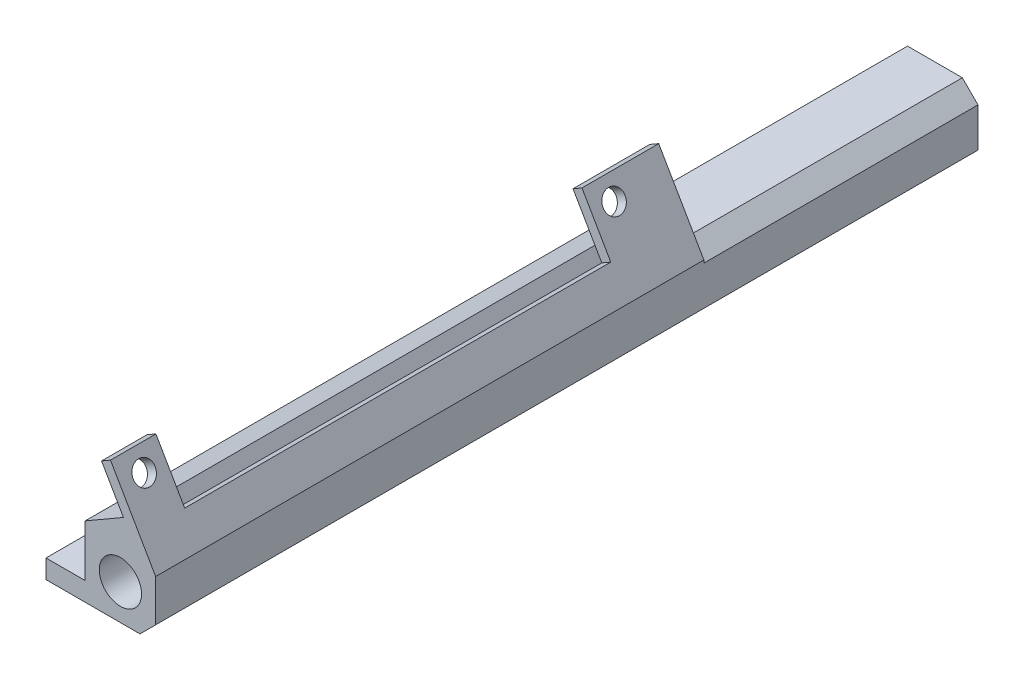
ISO-10303-21;
HEADER;
FILE_DESCRIPTION(('STEP AP214'),'2;1');
FILE_NAME('part.step','',(''),(''),'','','');
FILE_SCHEMA(('AUTOMOTIVE_DESIGN { 1 0 10303 214 1 1 1 1 }'));
ENDSEC;
DATA;
#1=APPLICATION_CONTEXT('core data for automotive mechanical design processes');
#2=APPLICATION_PROTOCOL_DEFINITION('international standard','automotive_design',2000,#1);
#3=PRODUCT_CONTEXT('',#1,'mechanical');
#4=PRODUCT('Part','Part','',(#3));
#5=PRODUCT_RELATED_PRODUCT_CATEGORY('part','',(#4));
#6=PRODUCT_DEFINITION_FORMATION('','',#4);
#7=PRODUCT_DEFINITION_CONTEXT('part definition',#1,'design');
#8=PRODUCT_DEFINITION('design','',#6,#7);
#9=PRODUCT_DEFINITION_SHAPE('','',#8);
#10=(LENGTH_UNIT() NAMED_UNIT(*) SI_UNIT(.MILLI.,.METRE.));
#11=(NAMED_UNIT(*) PLANE_ANGLE_UNIT() SI_UNIT($,.RADIAN.));
#12=(NAMED_UNIT(*) SI_UNIT($,.STERADIAN.) SOLID_ANGLE_UNIT());
#13=UNCERTAINTY_MEASURE_WITH_UNIT(LENGTH_MEASURE(1.E-05),#10,'distance_accuracy_value','');
#14=(GEOMETRIC_REPRESENTATION_CONTEXT(3) GLOBAL_UNCERTAINTY_ASSIGNED_CONTEXT((#13)) GLOBAL_UNIT_ASSIGNED_CONTEXT((#10,
#11,#12)) REPRESENTATION_CONTEXT('',''));
#15=CARTESIAN_POINT('',(0.,0.,0.));
#16=DIRECTION('',(0.,0.,1.));
#17=DIRECTION('',(1.,0.,0.));
#18=AXIS2_PLACEMENT_3D('',#15,#16,#17);
#19=CARTESIAN_POINT('',(69.3299914599108,20.0752380002228,-133.35));
#20=DIRECTION('',(0.866025403784438,0.500000000000001,0.));
#21=DIRECTION('',(-0.500000000000001,0.866025403784438,0.));
#22=AXIS2_PLACEMENT_3D('',#19,#20,#21);
#23=PLANE('',#22);
#24=CARTESIAN_POINT('',(70.3459914599109,18.3154743797327,-80.01));
#25=DIRECTION('',(0.866025403784438,0.500000000000001,0.));
#26=DIRECTION('',(-0.500000000000001,0.866025403784438,0.));
#27=AXIS2_PLACEMENT_3D('',#24,#25,#26);
#28=CIRCLE('',#27,1.77800000000001);
#29=CARTESIAN_POINT('',(69.4569914599109,19.8552675476615,-80.01));
#30=VERTEX_POINT('',#29);
#31=EDGE_CURVE('E331',#30,#30,#28,.F.);
#32=ORIENTED_EDGE('',*,*,#31,.F.);
#33=EDGE_LOOP('',(#32));
#34=FACE_BOUND('',#33,.T.);
#35=DIRECTION('',(0.,0.,1.));
#36=VECTOR('',#35,1.);
#37=CARTESIAN_POINT('',(72.2509914599109,15.015917591314,-133.35));
#38=LINE('',#37,#36);
#39=CARTESIAN_POINT('',(72.2509914599109,15.015917591314,-88.9));
#40=VERTEX_POINT('',#39);
#41=CARTESIAN_POINT('',(72.2509914599109,15.015917591314,-76.454));
#42=VERTEX_POINT('',#41);
#43=EDGE_CURVE('E321',#40,#42,#38,.T.);
#44=ORIENTED_EDGE('',*,*,#43,.T.);
#45=DIRECTION('',(0.500000000000001,-0.866025403784438,0.));
#46=VECTOR('',#45,1.);
#47=CARTESIAN_POINT('',(68.6949914599108,21.1750902630291,-76.454));
#48=LINE('',#47,#46);
#49=CARTESIAN_POINT('',(68.6949914599108,21.1750902630291,-76.454));
#50=VERTEX_POINT('',#49);
#51=EDGE_CURVE('E378',#50,#42,#48,.T.);
#52=ORIENTED_EDGE('',*,*,#51,.F.);
#53=DIRECTION('',(0.,0.,1.));
#54=VECTOR('',#53,1.);
#55=CARTESIAN_POINT('',(68.6949914599109,21.1750902630289,0.));
#56=LINE('',#55,#54);
#57=CARTESIAN_POINT('',(68.6949914599109,21.1750902630289,-88.9));
#58=VERTEX_POINT('',#57);
#59=EDGE_CURVE('E330',#58,#50,#56,.T.);
#60=ORIENTED_EDGE('',*,*,#59,.F.);
#61=DIRECTION('',(0.500000000000001,-0.866025403784438,0.));
#62=VECTOR('',#61,1.);
#63=CARTESIAN_POINT('',(60.6903266425389,35.0395764242762,-88.9));
#64=LINE('',#63,#62);
#65=EDGE_CURVE('E179',#58,#40,#64,.T.);
#66=ORIENTED_EDGE('',*,*,#65,.T.);
#67=EDGE_LOOP('',(#44,#52,#60,#66));
#68=FACE_BOUND('',#67,.T.);
#69=ADVANCED_FACE('F38',(#34,#68),#23,.F.);
#70=CARTESIAN_POINT('',(8.00466481737211,-13.8644861612474,0.));
#71=DIRECTION('',(-0.500000000000003,0.866025403784437,0.));
#72=DIRECTION('',(-0.866025403784437,-0.500000000000003,0.));
#73=AXIS2_PLACEMENT_3D('',#70,#71,#72);
#74=PLANE('',#73);
#75=DIRECTION('',(-0.866025403784438,-0.500000000000001,0.));
#76=VECTOR('',#75,1.);
#77=CARTESIAN_POINT('',(75.6404699470002,25.185064137201,-76.454));
#78=LINE('',#77,#76);
#79=CARTESIAN_POINT('',(70.1471477371937,22.0134930806238,-76.454));
#80=VERTEX_POINT('',#79);
#81=EDGE_CURVE('E364',#80,#50,#78,.T.);
#82=ORIENTED_EDGE('',*,*,#81,.F.);
#83=DIRECTION('',(0.,0.,-1.));
#84=VECTOR('',#83,1.);
#85=CARTESIAN_POINT('',(70.1471477371938,22.0134930806236,0.));
#86=LINE('',#85,#84);
#87=CARTESIAN_POINT('',(70.1471477371938,22.0134930806236,-88.9));
#88=VERTEX_POINT('',#87);
#89=EDGE_CURVE('E359',#80,#88,#86,.T.);
#90=ORIENTED_EDGE('',*,*,#89,.T.);
#91=DIRECTION('',(-0.866025403784437,-0.500000000000003,0.));
#92=VECTOR('',#91,1.);
#93=CARTESIAN_POINT('',(70.1471477371938,22.0134930806236,-88.9));
#94=LINE('',#93,#92);
#95=EDGE_CURVE('E175',#88,#58,#94,.T.);
#96=ORIENTED_EDGE('',*,*,#95,.T.);
#97=ORIENTED_EDGE('',*,*,#59,.T.);
#98=EDGE_LOOP('',(#82,#90,#96,#97));
#99=FACE_BOUND('',#98,.T.);
#100=ADVANCED_FACE('F411',(#99),#74,.T.);
#101=CARTESIAN_POINT('',(53.34,0.,-82.55));
#102=DIRECTION('',(0.,0.,1.));
#103=DIRECTION('',(1.,0.,0.));
#104=AXIS2_PLACEMENT_3D('',#101,#102,#103);
#105=PLANE('',#104);
#106=DIRECTION('',(-1.,0.,0.));
#107=VECTOR('',#106,1.);
#108=CARTESIAN_POINT('',(59.69,3.048,-82.55));
#109=LINE('',#108,#107);
#110=CARTESIAN_POINT('',(66.04,3.048,-82.55));
#111=VERTEX_POINT('',#110);
#112=CARTESIAN_POINT('',(59.69,3.048,-82.55));
#113=VERTEX_POINT('',#112);
#114=EDGE_CURVE('E344',#111,#113,#109,.T.);
#115=ORIENTED_EDGE('',*,*,#114,.F.);
#116=DIRECTION('',(0.,1.,0.));
#117=VECTOR('',#116,1.);
#118=CARTESIAN_POINT('',(66.04,0.,-82.55));
#119=LINE('',#118,#117);
#120=CARTESIAN_POINT('',(66.04,0.,-82.55));
#121=VERTEX_POINT('',#120);
#122=EDGE_CURVE('E211',#121,#111,#119,.T.);
#123=ORIENTED_EDGE('',*,*,#122,.F.);
#124=DIRECTION('',(1.,0.,0.));
#125=VECTOR('',#124,1.);
#126=CARTESIAN_POINT('',(53.34,0.,-82.55));
#127=LINE('',#126,#125);
#128=CARTESIAN_POINT('',(59.69,0.,-82.55));
#129=VERTEX_POINT('',#128);
#130=EDGE_CURVE('E219',#129,#121,#127,.T.);
#131=ORIENTED_EDGE('',*,*,#130,.F.);
#132=DIRECTION('',(0.,-1.,0.));
#133=VECTOR('',#132,1.);
#134=CARTESIAN_POINT('',(59.69,5.08,-82.55));
#135=LINE('',#134,#133);
#136=EDGE_CURVE('E266',#113,#129,#135,.T.);
#137=ORIENTED_EDGE('',*,*,#136,.F.);
#138=EDGE_LOOP('',(#115,#123,#131,#137));
#139=FACE_BOUND('',#138,.T.);
#140=ADVANCED_FACE('F408',(#139),#105,.F.);
#141=CARTESIAN_POINT('',(62.23,0.,-13.97));
#142=DIRECTION('',(0.,1.,0.));
#143=DIRECTION('',(0.,0.,1.));
#144=AXIS2_PLACEMENT_3D('',#141,#142,#143);
#145=CYLINDRICAL_SURFACE('',#144,1.778);
#146=CARTESIAN_POINT('',(62.23,0.,-13.97));
#147=DIRECTION('',(0.,1.,0.));
#148=DIRECTION('',(0.,0.,1.));
#149=AXIS2_PLACEMENT_3D('',#146,#147,#148);
#150=CIRCLE('',#149,1.778);
#151=CARTESIAN_POINT('',(62.23,0.,-12.192));
#152=VERTEX_POINT('',#151);
#153=EDGE_CURVE('E205',#152,#152,#150,.T.);
#154=ORIENTED_EDGE('',*,*,#153,.F.);
#155=EDGE_LOOP('',(#154));
#156=FACE_BOUND('',#155,.T.);
#157=CARTESIAN_POINT('',(62.23,3.048,-13.97));
#158=DIRECTION('',(0.,1.,0.));
#159=DIRECTION('',(-1.,0.,0.));
#160=AXIS2_PLACEMENT_3D('',#157,#158,#159);
#161=CIRCLE('',#160,1.778);
#162=CARTESIAN_POINT('',(60.452,3.048,-13.97));
#163=VERTEX_POINT('',#162);
#164=EDGE_CURVE('E338',#163,#163,#161,.F.);
#165=ORIENTED_EDGE('',*,*,#164,.F.);
#166=EDGE_LOOP('',(#165));
#167=FACE_BOUND('',#166,.T.);
#168=ADVANCED_FACE('F410',(#156,#167),#145,.F.);
#169=CARTESIAN_POINT('',(62.23,0.,-74.93));
#170=DIRECTION('',(0.,1.,0.));
#171=DIRECTION('',(0.,0.,1.));
#172=AXIS2_PLACEMENT_3D('',#169,#170,#171);
#173=CYLINDRICAL_SURFACE('',#172,1.778);
#174=CARTESIAN_POINT('',(62.23,0.,-74.93));
#175=DIRECTION('',(0.,1.,0.));
#176=DIRECTION('',(0.,0.,1.));
#177=AXIS2_PLACEMENT_3D('',#174,#175,#176);
#178=CIRCLE('',#177,1.778);
#179=CARTESIAN_POINT('',(62.23,0.,-73.152));
#180=VERTEX_POINT('',#179);
#181=EDGE_CURVE('E208',#180,#180,#178,.T.);
#182=ORIENTED_EDGE('',*,*,#181,.F.);
#183=EDGE_LOOP('',(#182));
#184=FACE_BOUND('',#183,.T.);
#185=CARTESIAN_POINT('',(62.23,3.048,-74.93));
#186=DIRECTION('',(0.,1.,0.));
#187=DIRECTION('',(-1.,0.,0.));
#188=AXIS2_PLACEMENT_3D('',#185,#186,#187);
#189=CIRCLE('',#188,1.778);
#190=CARTESIAN_POINT('',(60.452,3.048,-74.93));
#191=VERTEX_POINT('',#190);
#192=EDGE_CURVE('E341',#191,#191,#189,.F.);
#193=ORIENTED_EDGE('',*,*,#192,.F.);
#194=EDGE_LOOP('',(#193));
#195=FACE_BOUND('',#194,.T.);
#196=ADVANCED_FACE('F417',(#184,#195),#173,.F.);
#197=CARTESIAN_POINT('',(59.69,5.08,-133.351));
#198=DIRECTION('',(1.,0.,0.));
#199=DIRECTION('',(0.,0.,-1.));
#200=AXIS2_PLACEMENT_3D('',#197,#198,#199);
#201=PLANE('',#200);
#202=DIRECTION('',(0.,0.,1.));
#203=VECTOR('',#202,1.);
#204=CARTESIAN_POINT('',(59.69,3.048,-82.55));
#205=LINE('',#204,#203);
#206=CARTESIAN_POINT('',(59.69,3.048,0.));
#207=VERTEX_POINT('',#206);
#208=EDGE_CURVE('E349',#113,#207,#205,.T.);
#209=ORIENTED_EDGE('',*,*,#208,.F.);
#210=ORIENTED_EDGE('',*,*,#136,.T.);
#211=DIRECTION('',(0.,0.,1.));
#212=VECTOR('',#211,1.);
#213=CARTESIAN_POINT('',(59.69,0.,-133.351));
#214=LINE('',#213,#212);
#215=CARTESIAN_POINT('',(59.69,0.,0.));
#216=VERTEX_POINT('',#215);
#217=EDGE_CURVE('E207',#129,#216,#214,.T.);
#218=ORIENTED_EDGE('',*,*,#217,.T.);
#219=DIRECTION('',(0.,1.,0.));
#220=VECTOR('',#219,1.);
#221=CARTESIAN_POINT('',(59.69,5.08,0.));
#222=LINE('',#221,#220);
#223=EDGE_CURVE('E272',#216,#207,#222,.T.);
#224=ORIENTED_EDGE('',*,*,#223,.T.);
#225=EDGE_LOOP('',(#209,#210,#218,#224));
#226=FACE_BOUND('',#225,.T.);
#227=ADVANCED_FACE('F278',(#226),#201,.F.);
#228=CARTESIAN_POINT('',(0.,11.43,0.));
#229=DIRECTION('',(0.,-1.,0.));
#230=DIRECTION('',(0.,0.,-1.));
#231=AXIS2_PLACEMENT_3D('',#228,#229,#230);
#232=PLANE('',#231);
#233=DIRECTION('',(0.,0.,-1.));
#234=VECTOR('',#233,1.);
#235=CARTESIAN_POINT('',(66.04,11.43,-133.35));
#236=LINE('',#235,#234);
#237=CARTESIAN_POINT('',(66.04,11.43,-88.9));
#238=VERTEX_POINT('',#237);
#239=CARTESIAN_POINT('',(66.04,11.43,-133.35));
#240=VERTEX_POINT('',#239);
#241=EDGE_CURVE('E218',#238,#240,#236,.T.);
#242=ORIENTED_EDGE('',*,*,#241,.F.);
#243=DIRECTION('',(1.,0.,0.));
#244=VECTOR('',#243,1.);
#245=CARTESIAN_POINT('',(66.04,11.43,-88.9));
#246=LINE('',#245,#244);
#247=CARTESIAN_POINT('',(74.93,11.43,-88.9));
#248=VERTEX_POINT('',#247);
#249=EDGE_CURVE('E197',#238,#248,#246,.T.);
#250=ORIENTED_EDGE('',*,*,#249,.T.);
#251=DIRECTION('',(0.,0.,-1.));
#252=VECTOR('',#251,1.);
#253=CARTESIAN_POINT('',(74.93,11.43,0.));
#254=LINE('',#253,#252);
#255=CARTESIAN_POINT('',(74.93,11.43,-133.35));
#256=VERTEX_POINT('',#255);
#257=EDGE_CURVE('E11',#248,#256,#254,.T.);
#258=ORIENTED_EDGE('',*,*,#257,.T.);
#259=DIRECTION('',(-1.,0.,0.));
#260=VECTOR('',#259,1.);
#261=CARTESIAN_POINT('',(0.,11.43,-133.35));
#262=LINE('',#261,#260);
#263=EDGE_CURVE('E237',#256,#240,#262,.T.);
#264=ORIENTED_EDGE('',*,*,#263,.T.);
#265=EDGE_LOOP('',(#242,#250,#258,#264));
#266=FACE_BOUND('',#265,.T.);
#267=ADVANCED_FACE('F307',(#266),#232,.F.);
#268=CARTESIAN_POINT('',(0.,11.43,-133.35));
#269=DIRECTION('',(0.,0.,1.));
#270=DIRECTION('',(1.,0.,0.));
#271=AXIS2_PLACEMENT_3D('',#268,#269,#270);
#272=PLANE('',#271);
#273=CARTESIAN_POINT('',(71.755,5.71500000000001,-133.35));
#274=DIRECTION('',(0.,0.,1.));
#275=DIRECTION('',(1.,0.,0.));
#276=AXIS2_PLACEMENT_3D('',#273,#274,#275);
#277=CIRCLE('',#276,3.429);
#278=CARTESIAN_POINT('',(75.184,5.71500000000001,-133.35));
#279=VERTEX_POINT('',#278);
#280=EDGE_CURVE('E231',#279,#279,#277,.T.);
#281=ORIENTED_EDGE('',*,*,#280,.T.);
#282=EDGE_LOOP('',(#281));
#283=FACE_BOUND('',#282,.T.);
#284=DIRECTION('',(0.,-1.,0.));
#285=VECTOR('',#284,1.);
#286=CARTESIAN_POINT('',(77.47,11.43,-133.35));
#287=LINE('',#286,#285);
#288=CARTESIAN_POINT('',(77.47,8.88999999999997,-133.35));
#289=VERTEX_POINT('',#288);
#290=CARTESIAN_POINT('',(77.47,2.54,-133.35));
#291=VERTEX_POINT('',#290);
#292=EDGE_CURVE('E240',#289,#291,#287,.T.);
#293=ORIENTED_EDGE('',*,*,#292,.T.);
#294=DIRECTION('',(-0.707106781186548,-0.707106781186548,0.));
#295=VECTOR('',#294,1.);
#296=CARTESIAN_POINT('',(77.47,2.54,-133.35));
#297=LINE('',#296,#295);
#298=CARTESIAN_POINT('',(74.93,0.,-133.35));
#299=VERTEX_POINT('',#298);
#300=EDGE_CURVE('E48',#291,#299,#297,.T.);
#301=ORIENTED_EDGE('',*,*,#300,.T.);
#302=DIRECTION('',(-1.,0.,0.));
#303=VECTOR('',#302,1.);
#304=CARTESIAN_POINT('',(0.,0.,-133.35));
#305=LINE('',#304,#303);
#306=CARTESIAN_POINT('',(66.04,0.,-133.35));
#307=VERTEX_POINT('',#306);
#308=EDGE_CURVE('E241',#299,#307,#305,.T.);
#309=ORIENTED_EDGE('',*,*,#308,.T.);
#310=DIRECTION('',(0.,1.,0.));
#311=VECTOR('',#310,1.);
#312=CARTESIAN_POINT('',(66.04,0.,-133.35));
#313=LINE('',#312,#311);
#314=EDGE_CURVE('E225',#307,#240,#313,.T.);
#315=ORIENTED_EDGE('',*,*,#314,.T.);
#316=ORIENTED_EDGE('',*,*,#263,.F.);
#317=DIRECTION('',(-0.707106781186546,0.707106781186549,0.));
#318=VECTOR('',#317,1.);
#319=CARTESIAN_POINT('',(74.93,11.43,-133.35));
#320=LINE('',#319,#318);
#321=EDGE_CURVE('E258',#256,#289,#320,.F.);
#322=ORIENTED_EDGE('',*,*,#321,.T.);
#323=EDGE_LOOP('',(#293,#301,#309,#315,#316,#322));
#324=FACE_BOUND('',#323,.T.);
#325=ADVANCED_FACE('F300',(#283,#324),#272,.F.);
#326=CARTESIAN_POINT('',(0.,11.43,0.));
#327=DIRECTION('',(0.,0.,-1.));
#328=DIRECTION('',(-1.,0.,0.));
#329=AXIS2_PLACEMENT_3D('',#326,#327,#328);
#330=PLANE('',#329);
#331=DIRECTION('',(0.,-1.,0.));
#332=VECTOR('',#331,1.);
#333=CARTESIAN_POINT('',(77.47,11.43,0.));
#334=LINE('',#333,#332);
#335=CARTESIAN_POINT('',(77.47,9.32994090512255,0.));
#336=VERTEX_POINT('',#335);
#337=CARTESIAN_POINT('',(77.47,2.54,0.));
#338=VERTEX_POINT('',#337);
#339=EDGE_CURVE('E246',#336,#338,#334,.T.);
#340=ORIENTED_EDGE('',*,*,#339,.F.);
#341=DIRECTION('',(0.499999999999999,-0.866025403784439,0.));
#342=VECTOR('',#341,1.);
#343=CARTESIAN_POINT('',(70.7821477371937,20.9136408178175,0.));
#344=LINE('',#343,#342);
#345=CARTESIAN_POINT('',(70.1471477371938,22.0134930806236,0.));
#346=VERTEX_POINT('',#345);
#347=EDGE_CURVE('E178',#346,#336,#344,.T.);
#348=ORIENTED_EDGE('',*,*,#347,.F.);
#349=DIRECTION('',(0.866025403784437,0.500000000000003,0.));
#350=VECTOR('',#349,1.);
#351=CARTESIAN_POINT('',(70.1471477371938,22.0134930806236,0.));
#352=LINE('',#351,#350);
#353=CARTESIAN_POINT('',(68.6949914599109,21.1750902630289,0.));
#354=VERTEX_POINT('',#353);
#355=EDGE_CURVE('E351',#354,#346,#352,.T.);
#356=ORIENTED_EDGE('',*,*,#355,.F.);
#357=DIRECTION('',(-0.500000000000001,0.866025403784438,0.));
#358=VECTOR('',#357,1.);
#359=CARTESIAN_POINT('',(69.3299914599108,20.0752380002228,0.));
#360=LINE('',#359,#358);
#361=CARTESIAN_POINT('',(72.2509914599109,15.015917591314,0.));
#362=VERTEX_POINT('',#361);
#363=EDGE_CURVE('E335',#362,#354,#360,.T.);
#364=ORIENTED_EDGE('',*,*,#363,.F.);
#365=DIRECTION('',(-0.866025403784439,-0.499999999999999,0.));
#366=VECTOR('',#365,1.);
#367=CARTESIAN_POINT('',(71.5392613140312,14.605,0.));
#368=LINE('',#367,#366);
#369=CARTESIAN_POINT('',(66.04,11.43,0.));
#370=VERTEX_POINT('',#369);
#371=EDGE_CURVE('E199',#362,#370,#368,.T.);
#372=ORIENTED_EDGE('',*,*,#371,.T.);
#373=DIRECTION('',(0.,-1.,0.));
#374=VECTOR('',#373,1.);
#375=CARTESIAN_POINT('',(66.04,11.43,0.));
#376=LINE('',#375,#374);
#377=CARTESIAN_POINT('',(66.04,3.048,0.));
#378=VERTEX_POINT('',#377);
#379=EDGE_CURVE('E216',#370,#378,#376,.T.);
#380=ORIENTED_EDGE('',*,*,#379,.T.);
#381=DIRECTION('',(1.,0.,0.));
#382=VECTOR('',#381,1.);
#383=CARTESIAN_POINT('',(59.69,3.048,0.));
#384=LINE('',#383,#382);
#385=EDGE_CURVE('E288',#207,#378,#384,.T.);
#386=ORIENTED_EDGE('',*,*,#385,.F.);
#387=ORIENTED_EDGE('',*,*,#223,.F.);
#388=DIRECTION('',(1.,0.,0.));
#389=VECTOR('',#388,1.);
#390=CARTESIAN_POINT('',(0.,0.,0.));
#391=LINE('',#390,#389);
#392=CARTESIAN_POINT('',(74.93,0.,0.));
#393=VERTEX_POINT('',#392);
#394=EDGE_CURVE('E234',#216,#393,#391,.T.);
#395=ORIENTED_EDGE('',*,*,#394,.T.);
#396=DIRECTION('',(0.707106781186548,0.707106781186548,0.));
#397=VECTOR('',#396,1.);
#398=CARTESIAN_POINT('',(77.47,2.54,0.));
#399=LINE('',#398,#397);
#400=EDGE_CURVE('E248',#393,#338,#399,.T.);
#401=ORIENTED_EDGE('',*,*,#400,.T.);
#402=EDGE_LOOP('',(#340,#348,#356,#364,#372,#380,#386,#387,#395,#401));
#403=FACE_BOUND('',#402,.T.);
#404=CARTESIAN_POINT('',(71.755,5.71500000000001,0.));
#405=DIRECTION('',(0.,0.,1.));
#406=DIRECTION('',(1.,0.,0.));
#407=AXIS2_PLACEMENT_3D('',#404,#405,#406);
#408=CIRCLE('',#407,3.429);
#409=CARTESIAN_POINT('',(75.184,5.71500000000001,0.));
#410=VERTEX_POINT('',#409);
#411=EDGE_CURVE('E230',#410,#410,#408,.T.);
#412=ORIENTED_EDGE('',*,*,#411,.F.);
#413=EDGE_LOOP('',(#412));
#414=FACE_BOUND('',#413,.T.);
#415=ADVANCED_FACE('F285',(#403,#414),#330,.F.);
#416=CARTESIAN_POINT('',(77.47,11.43,0.));
#417=DIRECTION('',(-1.,0.,0.));
#418=DIRECTION('',(0.,0.,1.));
#419=AXIS2_PLACEMENT_3D('',#416,#417,#418);
#420=PLANE('',#419);
#421=DIRECTION('',(0.,1.,0.));
#422=VECTOR('',#421,1.);
#423=CARTESIAN_POINT('',(77.47,11.8699409051225,-88.9));
#424=LINE('',#423,#422);
#425=CARTESIAN_POINT('',(77.47,8.88999999999997,-88.9));
#426=VERTEX_POINT('',#425);
#427=CARTESIAN_POINT('',(77.47,9.32994090512255,-88.9));
#428=VERTEX_POINT('',#427);
#429=EDGE_CURVE('E172',#426,#428,#424,.T.);
#430=ORIENTED_EDGE('',*,*,#429,.T.);
#431=DIRECTION('',(0.,0.,-1.));
#432=VECTOR('',#431,1.);
#433=CARTESIAN_POINT('',(77.47,9.32994090512255,-88.9));
#434=LINE('',#433,#432);
#435=EDGE_CURVE('E182',#336,#428,#434,.T.);
#436=ORIENTED_EDGE('',*,*,#435,.F.);
#437=ORIENTED_EDGE('',*,*,#339,.T.);
#438=DIRECTION('',(0.,0.,-1.));
#439=VECTOR('',#438,1.);
#440=CARTESIAN_POINT('',(77.47,2.54,-133.35));
#441=LINE('',#440,#439);
#442=EDGE_CURVE('E255',#338,#291,#441,.T.);
#443=ORIENTED_EDGE('',*,*,#442,.T.);
#444=ORIENTED_EDGE('',*,*,#292,.F.);
#445=DIRECTION('',(0.,0.,1.));
#446=VECTOR('',#445,1.);
#447=CARTESIAN_POINT('',(77.47,8.88999999999997,0.));
#448=LINE('',#447,#446);
#449=EDGE_CURVE('E194',#289,#426,#448,.T.);
#450=ORIENTED_EDGE('',*,*,#449,.T.);
#451=EDGE_LOOP('',(#430,#436,#437,#443,#444,#450));
#452=FACE_BOUND('',#451,.T.);
#453=ADVANCED_FACE('F191',(#452),#420,.F.);
#454=CARTESIAN_POINT('',(0.,0.,0.));
#455=DIRECTION('',(0.,-1.,0.));
#456=DIRECTION('',(0.,0.,-1.));
#457=AXIS2_PLACEMENT_3D('',#454,#455,#456);
#458=PLANE('',#457);
#459=ORIENTED_EDGE('',*,*,#217,.F.);
#460=ORIENTED_EDGE('',*,*,#130,.T.);
#461=DIRECTION('',(0.,0.,-1.));
#462=VECTOR('',#461,1.);
#463=CARTESIAN_POINT('',(66.04,0.,-133.35));
#464=LINE('',#463,#462);
#465=EDGE_CURVE('E221',#121,#307,#464,.T.);
#466=ORIENTED_EDGE('',*,*,#465,.T.);
#467=ORIENTED_EDGE('',*,*,#308,.F.);
#468=DIRECTION('',(0.,0.,1.));
#469=VECTOR('',#468,1.);
#470=CARTESIAN_POINT('',(74.93,0.,0.));
#471=LINE('',#470,#469);
#472=EDGE_CURVE('E251',#299,#393,#471,.T.);
#473=ORIENTED_EDGE('',*,*,#472,.T.);
#474=ORIENTED_EDGE('',*,*,#394,.F.);
#475=EDGE_LOOP('',(#459,#460,#466,#467,#473,#474));
#476=FACE_BOUND('',#475,.T.);
#477=ORIENTED_EDGE('',*,*,#181,.T.);
#478=EDGE_LOOP('',(#477));
#479=FACE_BOUND('',#478,.T.);
#480=ORIENTED_EDGE('',*,*,#153,.T.);
#481=EDGE_LOOP('',(#480));
#482=FACE_BOUND('',#481,.T.);
#483=ADVANCED_FACE('F289',(#476,#479,#482),#458,.T.);
#484=CARTESIAN_POINT('',(71.755,5.71500000000001,-133.35));
#485=DIRECTION('',(0.,0.,1.));
#486=DIRECTION('',(1.,0.,0.));
#487=AXIS2_PLACEMENT_3D('',#484,#485,#486);
#488=CYLINDRICAL_SURFACE('',#487,3.429);
#489=ORIENTED_EDGE('',*,*,#280,.F.);
#490=EDGE_LOOP('',(#489));
#491=FACE_BOUND('',#490,.T.);
#492=ORIENTED_EDGE('',*,*,#411,.T.);
#493=EDGE_LOOP('',(#492));
#494=FACE_BOUND('',#493,.T.);
#495=ADVANCED_FACE('F457',(#491,#494),#488,.F.);
#496=CARTESIAN_POINT('',(66.04,0.,-133.35));
#497=DIRECTION('',(1.,0.,0.));
#498=DIRECTION('',(0.,0.,-1.));
#499=AXIS2_PLACEMENT_3D('',#496,#497,#498);
#500=PLANE('',#499);
#501=EDGE_CURVE('E222',#370,#238,#236,.T.);
#502=ORIENTED_EDGE('',*,*,#501,.T.);
#503=ORIENTED_EDGE('',*,*,#241,.T.);
#504=ORIENTED_EDGE('',*,*,#314,.F.);
#505=ORIENTED_EDGE('',*,*,#465,.F.);
#506=ORIENTED_EDGE('',*,*,#122,.T.);
#507=DIRECTION('',(0.,0.,-1.));
#508=VECTOR('',#507,1.);
#509=CARTESIAN_POINT('',(66.04,3.048,-82.55));
#510=LINE('',#509,#508);
#511=EDGE_CURVE('E346',#378,#111,#510,.T.);
#512=ORIENTED_EDGE('',*,*,#511,.F.);
#513=ORIENTED_EDGE('',*,*,#379,.F.);
#514=EDGE_LOOP('',(#502,#503,#504,#505,#506,#512,#513));
#515=FACE_BOUND('',#514,.T.);
#516=ADVANCED_FACE('F312',(#515),#500,.F.);
#517=CARTESIAN_POINT('',(77.47,2.54,0.));
#518=DIRECTION('',(0.707106781186548,-0.707106781186548,0.));
#519=DIRECTION('',(0.,0.,1.));
#520=AXIS2_PLACEMENT_3D('',#517,#518,#519);
#521=PLANE('',#520);
#522=ORIENTED_EDGE('',*,*,#400,.F.);
#523=ORIENTED_EDGE('',*,*,#472,.F.);
#524=ORIENTED_EDGE('',*,*,#300,.F.);
#525=ORIENTED_EDGE('',*,*,#442,.F.);
#526=EDGE_LOOP('',(#522,#523,#524,#525));
#527=FACE_BOUND('',#526,.T.);
#528=ADVANCED_FACE('F296',(#527),#521,.T.);
#529=CARTESIAN_POINT('',(74.93,11.43,0.));
#530=DIRECTION('',(-0.707106781186549,-0.707106781186545,0.));
#531=DIRECTION('',(0.,0.,-1.));
#532=AXIS2_PLACEMENT_3D('',#529,#530,#531);
#533=PLANE('',#532);
#534=DIRECTION('',(0.70710678118654,-0.707106781186555,0.));
#535=VECTOR('',#534,1.);
#536=CARTESIAN_POINT('',(74.93,11.43,-88.9));
#537=LINE('',#536,#535);
#538=EDGE_CURVE('E195',#248,#426,#537,.T.);
#539=ORIENTED_EDGE('',*,*,#538,.T.);
#540=ORIENTED_EDGE('',*,*,#449,.F.);
#541=ORIENTED_EDGE('',*,*,#321,.F.);
#542=ORIENTED_EDGE('',*,*,#257,.F.);
#543=EDGE_LOOP('',(#539,#540,#541,#542));
#544=FACE_BOUND('',#543,.T.);
#545=ADVANCED_FACE('F41',(#544),#533,.F.);
#546=CARTESIAN_POINT('',(71.5392613140312,14.605,-88.9));
#547=DIRECTION('',(-0.499999999999999,0.866025403784439,0.));
#548=DIRECTION('',(-0.866025403784439,-0.499999999999999,0.));
#549=AXIS2_PLACEMENT_3D('',#546,#547,#548);
#550=PLANE('',#549);
#551=ORIENTED_EDGE('',*,*,#501,.F.);
#552=ORIENTED_EDGE('',*,*,#371,.F.);
#553=CARTESIAN_POINT('',(72.2509914599109,15.015917591314,-7.366));
#554=VERTEX_POINT('',#553);
#555=EDGE_CURVE('E326',#554,#362,#38,.T.);
#556=ORIENTED_EDGE('',*,*,#555,.F.);
#557=DIRECTION('',(0.,0.,1.));
#558=VECTOR('',#557,1.);
#559=CARTESIAN_POINT('',(72.2509914599109,15.015917591314,-88.9));
#560=LINE('',#559,#558);
#561=EDGE_CURVE('E323',#42,#554,#560,.T.);
#562=ORIENTED_EDGE('',*,*,#561,.F.);
#563=ORIENTED_EDGE('',*,*,#43,.F.);
#564=DIRECTION('',(-0.866025403784439,-0.499999999999999,0.));
#565=VECTOR('',#564,1.);
#566=CARTESIAN_POINT('',(71.5392613140312,14.605,-88.9));
#567=LINE('',#566,#565);
#568=EDGE_CURVE('E64',#40,#238,#567,.T.);
#569=ORIENTED_EDGE('',*,*,#568,.T.);
#570=EDGE_LOOP('',(#551,#552,#556,#562,#563,#569));
#571=FACE_BOUND('',#570,.T.);
#572=ADVANCED_FACE('F316',(#571),#550,.T.);
#573=CARTESIAN_POINT('',(0.,0.,-88.9));
#574=DIRECTION('',(0.,0.,-1.));
#575=DIRECTION('',(-1.,0.,0.));
#576=AXIS2_PLACEMENT_3D('',#573,#574,#575);
#577=PLANE('',#576);
#578=DIRECTION('',(-0.499999999999999,0.866025403784439,0.));
#579=VECTOR('',#578,1.);
#580=CARTESIAN_POINT('',(70.7821477371937,20.9136408178175,-88.9));
#581=LINE('',#580,#579);
#582=EDGE_CURVE('E168',#428,#88,#581,.T.);
#583=ORIENTED_EDGE('',*,*,#582,.F.);
#584=ORIENTED_EDGE('',*,*,#429,.F.);
#585=ORIENTED_EDGE('',*,*,#538,.F.);
#586=ORIENTED_EDGE('',*,*,#249,.F.);
#587=ORIENTED_EDGE('',*,*,#568,.F.);
#588=ORIENTED_EDGE('',*,*,#65,.F.);
#589=ORIENTED_EDGE('',*,*,#95,.F.);
#590=EDGE_LOOP('',(#583,#584,#585,#586,#587,#588,#589));
#591=FACE_BOUND('',#590,.T.);
#592=ADVANCED_FACE('F170',(#591),#577,.T.);
#593=CARTESIAN_POINT('',(77.0901830127019,22.209235188203,-80.01));
#594=DIRECTION('',(-0.86602540378444,-0.499999999999997,0.));
#595=DIRECTION('',(0.499999999999997,-0.86602540378444,0.));
#596=AXIS2_PLACEMENT_3D('',#593,#594,#595);
#597=CYLINDRICAL_SURFACE('',#596,1.77800000000001);
#598=ORIENTED_EDGE('',*,*,#31,.T.);
#599=EDGE_LOOP('',(#598));
#600=FACE_BOUND('',#599,.T.);
#601=CARTESIAN_POINT('',(71.7981477371938,19.1538771973274,-80.01));
#602=DIRECTION('',(-0.866025403784439,-0.499999999999999,0.));
#603=DIRECTION('',(0.499999999999999,-0.866025403784439,0.));
#604=AXIS2_PLACEMENT_3D('',#601,#602,#603);
#605=CIRCLE('',#604,1.77800000000001);
#606=CARTESIAN_POINT('',(72.6871477371938,17.6140840293987,-80.01));
#607=VERTEX_POINT('',#606);
#608=EDGE_CURVE('E262',#607,#607,#605,.F.);
#609=ORIENTED_EDGE('',*,*,#608,.T.);
#610=EDGE_LOOP('',(#609));
#611=FACE_BOUND('',#610,.T.);
#612=ADVANCED_FACE('F441',(#600,#611),#597,.F.);
#613=CARTESIAN_POINT('',(77.0901830127019,22.209235188203,-3.80999999999999));
#614=DIRECTION('',(-0.86602540378444,-0.499999999999997,0.));
#615=DIRECTION('',(0.499999999999997,-0.86602540378444,0.));
#616=AXIS2_PLACEMENT_3D('',#613,#614,#615);
#617=CYLINDRICAL_SURFACE('',#616,1.778);
#618=CARTESIAN_POINT('',(70.3459914599109,18.3154743797327,-3.80999999999999));
#619=DIRECTION('',(0.866025403784438,0.500000000000001,0.));
#620=DIRECTION('',(-0.500000000000001,0.866025403784438,0.));
#621=AXIS2_PLACEMENT_3D('',#618,#619,#620);
#622=CIRCLE('',#621,1.778);
#623=CARTESIAN_POINT('',(69.4569914599109,19.8552675476615,-3.80999999999999));
#624=VERTEX_POINT('',#623);
#625=EDGE_CURVE('E43',#624,#624,#622,.F.);
#626=ORIENTED_EDGE('',*,*,#625,.T.);
#627=EDGE_LOOP('',(#626));
#628=FACE_BOUND('',#627,.T.);
#629=CARTESIAN_POINT('',(71.7981477371938,19.1538771973274,-3.80999999999999));
#630=DIRECTION('',(-0.866025403784439,-0.499999999999999,0.));
#631=DIRECTION('',(0.499999999999999,-0.866025403784439,0.));
#632=AXIS2_PLACEMENT_3D('',#629,#630,#631);
#633=CIRCLE('',#632,1.778);
#634=CARTESIAN_POINT('',(72.6871477371938,17.6140840293987,-3.80999999999999));
#635=VERTEX_POINT('',#634);
#636=EDGE_CURVE('E260',#635,#635,#633,.F.);
#637=ORIENTED_EDGE('',*,*,#636,.T.);
#638=EDGE_LOOP('',(#637));
#639=FACE_BOUND('',#638,.T.);
#640=ADVANCED_FACE('F437',(#628,#639),#617,.F.);
#641=CARTESIAN_POINT('',(62.1424829198219,35.8779792418708,0.));
#642=DIRECTION('',(-0.866025403784439,-0.499999999999999,0.));
#643=DIRECTION('',(0.499999999999999,-0.866025403784439,0.));
#644=AXIS2_PLACEMENT_3D('',#641,#642,#643);
#645=PLANE('',#644);
#646=ORIENTED_EDGE('',*,*,#89,.F.);
#647=DIRECTION('',(-0.499999999999999,0.866025403784439,0.));
#648=VECTOR('',#647,1.);
#649=CARTESIAN_POINT('',(70.1471477371937,22.0134930806238,-76.454));
#650=LINE('',#649,#648);
#651=CARTESIAN_POINT('',(74.8143977371937,13.9295789489979,-76.454));
#652=VERTEX_POINT('',#651);
#653=EDGE_CURVE('E382',#652,#80,#650,.T.);
#654=ORIENTED_EDGE('',*,*,#653,.F.);
#655=DIRECTION('',(0.,0.,-1.));
#656=VECTOR('',#655,1.);
#657=CARTESIAN_POINT('',(74.8143977371937,13.9295789489979,-76.454));
#658=LINE('',#657,#656);
#659=CARTESIAN_POINT('',(74.8143977371937,13.9295789489979,-7.366));
#660=VERTEX_POINT('',#659);
#661=EDGE_CURVE('E361',#660,#652,#658,.T.);
#662=ORIENTED_EDGE('',*,*,#661,.F.);
#663=DIRECTION('',(0.499999999999999,-0.866025403784439,0.));
#664=VECTOR('',#663,1.);
#665=CARTESIAN_POINT('',(70.1471477371937,22.0134930806238,-7.366));
#666=LINE('',#665,#664);
#667=CARTESIAN_POINT('',(70.1471477371938,22.0134930806238,-7.366));
#668=VERTEX_POINT('',#667);
#669=EDGE_CURVE('E188',#668,#660,#666,.T.);
#670=ORIENTED_EDGE('',*,*,#669,.F.);
#671=EDGE_CURVE('E356',#346,#668,#86,.T.);
#672=ORIENTED_EDGE('',*,*,#671,.F.);
#673=ORIENTED_EDGE('',*,*,#347,.T.);
#674=ORIENTED_EDGE('',*,*,#435,.T.);
#675=ORIENTED_EDGE('',*,*,#582,.T.);
#676=EDGE_LOOP('',(#646,#654,#662,#670,#672,#673,#674,#675));
#677=FACE_BOUND('',#676,.T.);
#678=ORIENTED_EDGE('',*,*,#636,.F.);
#679=EDGE_LOOP('',(#678));
#680=FACE_BOUND('',#679,.T.);
#681=ORIENTED_EDGE('',*,*,#608,.F.);
#682=EDGE_LOOP('',(#681));
#683=FACE_BOUND('',#682,.T.);
#684=ADVANCED_FACE('F183',(#677,#680,#683),#645,.F.);
#685=CARTESIAN_POINT('',(68.6949914599109,21.1750902630289,-7.366));
#686=VERTEX_POINT('',#685);
#687=EDGE_CURVE('E354',#686,#354,#56,.T.);
#688=ORIENTED_EDGE('',*,*,#687,.F.);
#689=DIRECTION('',(-0.500000000000001,0.866025403784438,0.));
#690=VECTOR('',#689,1.);
#691=CARTESIAN_POINT('',(68.6949914599108,21.1750902630291,-7.366));
#692=LINE('',#691,#690);
#693=EDGE_CURVE('E56',#554,#686,#692,.T.);
#694=ORIENTED_EDGE('',*,*,#693,.F.);
#695=ORIENTED_EDGE('',*,*,#555,.T.);
#696=ORIENTED_EDGE('',*,*,#363,.T.);
#697=EDGE_LOOP('',(#688,#694,#695,#696));
#698=FACE_BOUND('',#697,.T.);
#699=ORIENTED_EDGE('',*,*,#625,.F.);
#700=EDGE_LOOP('',(#699));
#701=FACE_BOUND('',#700,.T.);
#702=ADVANCED_FACE('F397',(#698,#701),#23,.F.);
#703=CARTESIAN_POINT('',(0.,3.04799999999999,0.));
#704=DIRECTION('',(0.,1.,0.));
#705=DIRECTION('',(-1.,0.,0.));
#706=AXIS2_PLACEMENT_3D('',#703,#704,#705);
#707=PLANE('',#706);
#708=ORIENTED_EDGE('',*,*,#208,.T.);
#709=ORIENTED_EDGE('',*,*,#385,.T.);
#710=ORIENTED_EDGE('',*,*,#511,.T.);
#711=ORIENTED_EDGE('',*,*,#114,.T.);
#712=EDGE_LOOP('',(#708,#709,#710,#711));
#713=FACE_BOUND('',#712,.T.);
#714=ORIENTED_EDGE('',*,*,#192,.T.);
#715=EDGE_LOOP('',(#714));
#716=FACE_BOUND('',#715,.T.);
#717=ORIENTED_EDGE('',*,*,#164,.T.);
#718=EDGE_LOOP('',(#717));
#719=FACE_BOUND('',#718,.T.);
#720=ADVANCED_FACE('F405',(#713,#716,#719),#707,.T.);
#721=DIRECTION('',(-0.866025403784438,-0.500000000000001,0.));
#722=VECTOR('',#721,1.);
#723=CARTESIAN_POINT('',(75.6404699470002,25.185064137201,-7.366));
#724=LINE('',#723,#722);
#725=EDGE_CURVE('E371',#668,#686,#724,.T.);
#726=ORIENTED_EDGE('',*,*,#725,.T.);
#727=ORIENTED_EDGE('',*,*,#687,.T.);
#728=ORIENTED_EDGE('',*,*,#355,.T.);
#729=ORIENTED_EDGE('',*,*,#671,.T.);
#730=EDGE_LOOP('',(#726,#727,#728,#729));
#731=FACE_BOUND('',#730,.T.);
#732=ADVANCED_FACE('F400',(#731),#74,.T.);
#733=CARTESIAN_POINT('',(75.6404699470002,25.185064137201,-76.454));
#734=DIRECTION('',(0.,0.,-1.));
#735=DIRECTION('',(-1.,0.,0.));
#736=AXIS2_PLACEMENT_3D('',#733,#734,#735);
#737=PLANE('',#736);
#738=ORIENTED_EDGE('',*,*,#653,.T.);
#739=ORIENTED_EDGE('',*,*,#81,.T.);
#740=ORIENTED_EDGE('',*,*,#51,.T.);
#741=CARTESIAN_POINT('',(73.3622414599108,13.0911761314033,-76.454));
#742=VERTEX_POINT('',#741);
#743=EDGE_CURVE('E381',#42,#742,#48,.T.);
#744=ORIENTED_EDGE('',*,*,#743,.T.);
#745=DIRECTION('',(-0.866025403784438,-0.500000000000001,0.));
#746=VECTOR('',#745,1.);
#747=CARTESIAN_POINT('',(80.3077199470002,17.1011500055751,-76.454));
#748=LINE('',#747,#746);
#749=EDGE_CURVE('E365',#652,#742,#748,.T.);
#750=ORIENTED_EDGE('',*,*,#749,.F.);
#751=EDGE_LOOP('',(#738,#739,#740,#744,#750));
#752=FACE_BOUND('',#751,.T.);
#753=ADVANCED_FACE('F585',(#752),#737,.F.);
#754=CARTESIAN_POINT('',(75.6404699470002,25.185064137201,-7.366));
#755=DIRECTION('',(0.,0.,1.));
#756=DIRECTION('',(0.,-1.,0.));
#757=AXIS2_PLACEMENT_3D('',#754,#755,#756);
#758=PLANE('',#757);
#759=ORIENTED_EDGE('',*,*,#669,.T.);
#760=DIRECTION('',(-0.866025403784438,-0.500000000000001,0.));
#761=VECTOR('',#760,1.);
#762=CARTESIAN_POINT('',(80.3077199470002,17.1011500055751,-7.366));
#763=LINE('',#762,#761);
#764=CARTESIAN_POINT('',(73.3622414599108,13.0911761314033,-7.366));
#765=VERTEX_POINT('',#764);
#766=EDGE_CURVE('E368',#660,#765,#763,.T.);
#767=ORIENTED_EDGE('',*,*,#766,.T.);
#768=EDGE_CURVE('E369',#765,#554,#692,.T.);
#769=ORIENTED_EDGE('',*,*,#768,.T.);
#770=ORIENTED_EDGE('',*,*,#693,.T.);
#771=ORIENTED_EDGE('',*,*,#725,.F.);
#772=EDGE_LOOP('',(#759,#767,#769,#770,#771));
#773=FACE_BOUND('',#772,.T.);
#774=ADVANCED_FACE('F387',(#773),#758,.F.);
#775=CARTESIAN_POINT('',(80.3077199470002,17.1011500055751,-76.454));
#776=DIRECTION('',(0.500000000000001,-0.866025403784438,0.));
#777=DIRECTION('',(0.866025403784438,0.500000000000001,0.));
#778=AXIS2_PLACEMENT_3D('',#775,#776,#777);
#779=PLANE('',#778);
#780=ORIENTED_EDGE('',*,*,#661,.T.);
#781=ORIENTED_EDGE('',*,*,#749,.T.);
#782=DIRECTION('',(0.,0.,1.));
#783=VECTOR('',#782,1.);
#784=CARTESIAN_POINT('',(73.3622414599108,13.0911761314033,-76.454));
#785=LINE('',#784,#783);
#786=EDGE_CURVE('E375',#742,#765,#785,.T.);
#787=ORIENTED_EDGE('',*,*,#786,.T.);
#788=ORIENTED_EDGE('',*,*,#766,.F.);
#789=EDGE_LOOP('',(#780,#781,#787,#788));
#790=FACE_BOUND('',#789,.T.);
#791=ADVANCED_FACE('F391',(#790),#779,.F.);
#792=CARTESIAN_POINT('',(60.6903266425389,35.0395764242762,0.));
#793=DIRECTION('',(-0.866025403784438,-0.500000000000001,0.));
#794=DIRECTION('',(0.500000000000001,-0.866025403784438,0.));
#795=AXIS2_PLACEMENT_3D('',#792,#793,#794);
#796=PLANE('',#795);
#797=ORIENTED_EDGE('',*,*,#561,.T.);
#798=ORIENTED_EDGE('',*,*,#768,.F.);
#799=ORIENTED_EDGE('',*,*,#786,.F.);
#800=ORIENTED_EDGE('',*,*,#743,.F.);
#801=EDGE_LOOP('',(#797,#798,#799,#800));
#802=FACE_BOUND('',#801,.T.);
#803=ADVANCED_FACE('F394',(#802),#796,.F.);
#804=CLOSED_SHELL('',(#69,#100,#140,#168,#196,#227,#267,#325,#415,#453,#483,#495,#516,#528,#545,
#572,#592,#612,#640,#684,#702,#720,#732,#753,#774,#791,#803));
#805=MANIFOLD_SOLID_BREP('B2',#804);
#806=ADVANCED_BREP_SHAPE_REPRESENTATION('',(#18,#805),#14);
#807=SHAPE_DEFINITION_REPRESENTATION(#9,#806);
ENDSEC;
END-ISO-10303-21;
